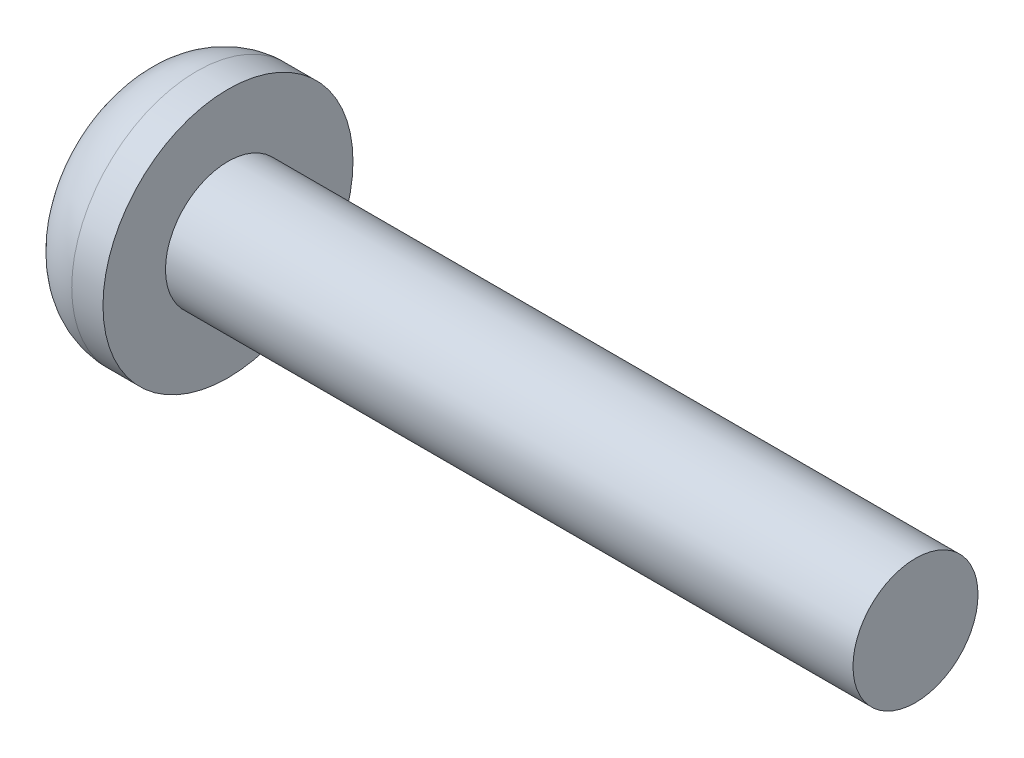
ISO-10303-21;
HEADER;
FILE_DESCRIPTION(('STEP AP214'),'2;1');
FILE_NAME('part.step','',(''),(''),'','','');
FILE_SCHEMA(('AUTOMOTIVE_DESIGN { 1 0 10303 214 1 1 1 1 }'));
ENDSEC;
DATA;
#1=APPLICATION_CONTEXT('core data for automotive mechanical design processes');
#2=APPLICATION_PROTOCOL_DEFINITION('international standard','automotive_design',2000,#1);
#3=PRODUCT_CONTEXT('',#1,'mechanical');
#4=PRODUCT('Part','Part','',(#3));
#5=PRODUCT_RELATED_PRODUCT_CATEGORY('part','',(#4));
#6=PRODUCT_DEFINITION_FORMATION('','',#4);
#7=PRODUCT_DEFINITION_CONTEXT('part definition',#1,'design');
#8=PRODUCT_DEFINITION('design','',#6,#7);
#9=PRODUCT_DEFINITION_SHAPE('','',#8);
#10=(LENGTH_UNIT() NAMED_UNIT(*) SI_UNIT(.MILLI.,.METRE.));
#11=(NAMED_UNIT(*) PLANE_ANGLE_UNIT() SI_UNIT($,.RADIAN.));
#12=(NAMED_UNIT(*) SI_UNIT($,.STERADIAN.) SOLID_ANGLE_UNIT());
#13=UNCERTAINTY_MEASURE_WITH_UNIT(LENGTH_MEASURE(1.E-05),#10,'distance_accuracy_value','');
#14=(GEOMETRIC_REPRESENTATION_CONTEXT(3) GLOBAL_UNCERTAINTY_ASSIGNED_CONTEXT((#13)) GLOBAL_UNIT_ASSIGNED_CONTEXT((#10,
#11,#12)) REPRESENTATION_CONTEXT('',''));
#15=CARTESIAN_POINT('',(0.,0.,0.));
#16=DIRECTION('',(0.,0.,1.));
#17=DIRECTION('',(1.,0.,0.));
#18=AXIS2_PLACEMENT_3D('',#15,#16,#17);
#19=CARTESIAN_POINT('',(11.,0.,0.));
#20=DIRECTION('',(-1.,0.,0.));
#21=DIRECTION('',(0.,0.,1.));
#22=AXIS2_PLACEMENT_3D('',#19,#20,#21);
#23=CYLINDRICAL_SURFACE('',#22,1.);
#24=CARTESIAN_POINT('',(11.,0.,0.));
#25=DIRECTION('',(1.,0.,0.));
#26=DIRECTION('',(0.,0.,-1.));
#27=AXIS2_PLACEMENT_3D('',#24,#25,#26);
#28=CIRCLE('',#27,1.);
#29=CARTESIAN_POINT('',(11.,0.,-1.));
#30=VERTEX_POINT('',#29);
#31=EDGE_CURVE('E42',#30,#30,#28,.T.);
#32=ORIENTED_EDGE('',*,*,#31,.F.);
#33=EDGE_LOOP('',(#32));
#34=FACE_BOUND('',#33,.T.);
#35=CARTESIAN_POINT('',(0.,0.,0.));
#36=DIRECTION('',(-1.,0.,0.));
#37=DIRECTION('',(0.,0.,1.));
#38=AXIS2_PLACEMENT_3D('',#35,#36,#37);
#39=CIRCLE('',#38,1.);
#40=CARTESIAN_POINT('',(0.,0.,1.));
#41=VERTEX_POINT('',#40);
#42=EDGE_CURVE('E46',#41,#41,#39,.T.);
#43=ORIENTED_EDGE('',*,*,#42,.F.);
#44=EDGE_LOOP('',(#43));
#45=FACE_BOUND('',#44,.T.);
#46=ADVANCED_FACE('F31',(#34,#45),#23,.T.);
#47=CARTESIAN_POINT('',(11.,0.,0.));
#48=DIRECTION('',(1.,0.,0.));
#49=DIRECTION('',(0.,0.,-1.));
#50=AXIS2_PLACEMENT_3D('',#47,#48,#49);
#51=PLANE('',#50);
#52=ORIENTED_EDGE('',*,*,#31,.T.);
#53=EDGE_LOOP('',(#52));
#54=FACE_BOUND('',#53,.T.);
#55=ADVANCED_FACE('F70',(#54),#51,.T.);
#56=CARTESIAN_POINT('',(-1.5,0.,0.));
#57=DIRECTION('',(1.,0.,0.));
#58=DIRECTION('',(0.,0.,-1.));
#59=AXIS2_PLACEMENT_3D('',#56,#57,#58);
#60=CYLINDRICAL_SURFACE('',#59,2.);
#61=CARTESIAN_POINT('',(-0.5,0.,0.));
#62=DIRECTION('',(-1.,0.,0.));
#63=DIRECTION('',(0.,0.,1.));
#64=AXIS2_PLACEMENT_3D('',#61,#62,#63);
#65=CIRCLE('',#64,2.);
#66=CARTESIAN_POINT('',(-0.5,0.,2.));
#67=VERTEX_POINT('',#66);
#68=EDGE_CURVE('E10',#67,#67,#65,.F.);
#69=ORIENTED_EDGE('',*,*,#68,.T.);
#70=EDGE_LOOP('',(#69));
#71=FACE_BOUND('',#70,.T.);
#72=CARTESIAN_POINT('',(0.,0.,0.));
#73=DIRECTION('',(-1.,0.,0.));
#74=DIRECTION('',(0.,0.,1.));
#75=AXIS2_PLACEMENT_3D('',#72,#73,#74);
#76=CIRCLE('',#75,2.);
#77=CARTESIAN_POINT('',(0.,0.,2.));
#78=VERTEX_POINT('',#77);
#79=EDGE_CURVE('E51',#78,#78,#76,.T.);
#80=ORIENTED_EDGE('',*,*,#79,.T.);
#81=EDGE_LOOP('',(#80));
#82=FACE_BOUND('',#81,.T.);
#83=ADVANCED_FACE('F55',(#71,#82),#60,.T.);
#84=CARTESIAN_POINT('',(-1.5,0.,0.));
#85=DIRECTION('',(-1.,0.,0.));
#86=DIRECTION('',(0.,0.,1.));
#87=AXIS2_PLACEMENT_3D('',#84,#85,#86);
#88=PLANE('',#87);
#89=CARTESIAN_POINT('',(-1.5,0.,0.));
#90=DIRECTION('',(-1.,0.,0.));
#91=DIRECTION('',(0.,0.,1.));
#92=AXIS2_PLACEMENT_3D('',#89,#90,#91);
#93=CIRCLE('',#92,1.);
#94=CARTESIAN_POINT('',(-1.5,0.,1.));
#95=VERTEX_POINT('',#94);
#96=EDGE_CURVE('E38',#95,#95,#93,.T.);
#97=ORIENTED_EDGE('',*,*,#96,.T.);
#98=EDGE_LOOP('',(#97));
#99=FACE_BOUND('',#98,.T.);
#100=ADVANCED_FACE('F59',(#99),#88,.T.);
#101=CARTESIAN_POINT('',(0.,0.,0.));
#102=DIRECTION('',(-1.,0.,0.));
#103=DIRECTION('',(0.,0.,1.));
#104=AXIS2_PLACEMENT_3D('',#101,#102,#103);
#105=PLANE('',#104);
#106=ORIENTED_EDGE('',*,*,#42,.T.);
#107=EDGE_LOOP('',(#106));
#108=FACE_BOUND('',#107,.T.);
#109=ORIENTED_EDGE('',*,*,#79,.F.);
#110=EDGE_LOOP('',(#109));
#111=FACE_BOUND('',#110,.T.);
#112=ADVANCED_FACE('F57',(#108,#111),#105,.F.);
#113=CARTESIAN_POINT('',(-0.5,0.,0.));
#114=DIRECTION('',(-1.,0.,0.));
#115=DIRECTION('',(0.,0.,1.));
#116=AXIS2_PLACEMENT_3D('',#113,#114,#115);
#117=DEGENERATE_TOROIDAL_SURFACE('',#116,1.,1.,.T.);
#118=ORIENTED_EDGE('',*,*,#68,.F.);
#119=EDGE_LOOP('',(#118));
#120=FACE_BOUND('',#119,.T.);
#121=ORIENTED_EDGE('',*,*,#96,.F.);
#122=EDGE_LOOP('',(#121));
#123=FACE_BOUND('',#122,.T.);
#124=ADVANCED_FACE('F33',(#120,#123),#117,.T.);
#125=CLOSED_SHELL('',(#46,#55,#83,#100,#112,#124));
#126=MANIFOLD_SOLID_BREP('B2',#125);
#127=ADVANCED_BREP_SHAPE_REPRESENTATION('',(#18,#126),#14);
#128=SHAPE_DEFINITION_REPRESENTATION(#9,#127);
ENDSEC;
END-ISO-10303-21;
